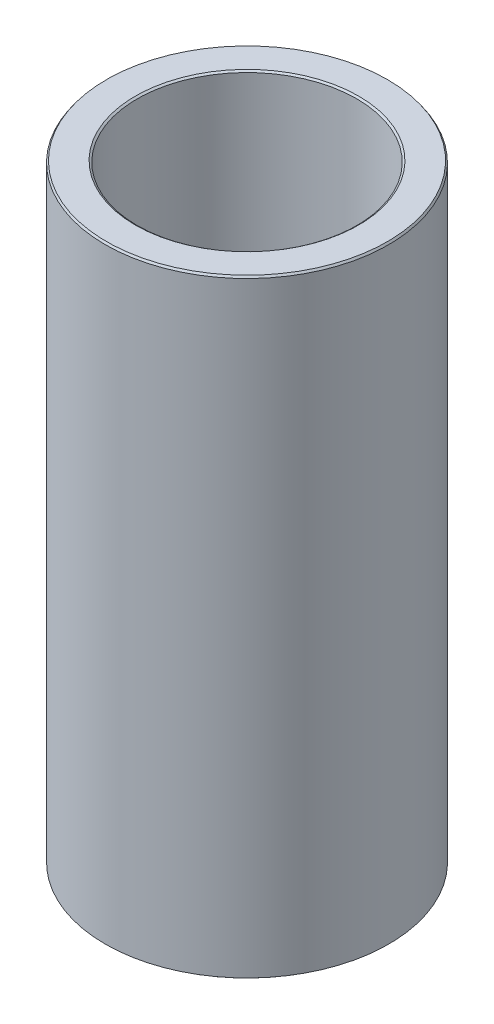
ISO-10303-21;
HEADER;
FILE_DESCRIPTION(('STEP AP214'),'2;1');
FILE_NAME('part.step','',(''),(''),'','','');
FILE_SCHEMA(('AUTOMOTIVE_DESIGN { 1 0 10303 214 1 1 1 1 }'));
ENDSEC;
DATA;
#1=APPLICATION_CONTEXT('core data for automotive mechanical design processes');
#2=APPLICATION_PROTOCOL_DEFINITION('international standard','automotive_design',2000,#1);
#3=PRODUCT_CONTEXT('',#1,'mechanical');
#4=PRODUCT('Part','Part','',(#3));
#5=PRODUCT_RELATED_PRODUCT_CATEGORY('part','',(#4));
#6=PRODUCT_DEFINITION_FORMATION('','',#4);
#7=PRODUCT_DEFINITION_CONTEXT('part definition',#1,'design');
#8=PRODUCT_DEFINITION('design','',#6,#7);
#9=PRODUCT_DEFINITION_SHAPE('','',#8);
#10=(LENGTH_UNIT() NAMED_UNIT(*) SI_UNIT(.MILLI.,.METRE.));
#11=(NAMED_UNIT(*) PLANE_ANGLE_UNIT() SI_UNIT($,.RADIAN.));
#12=(NAMED_UNIT(*) SI_UNIT($,.STERADIAN.) SOLID_ANGLE_UNIT());
#13=UNCERTAINTY_MEASURE_WITH_UNIT(LENGTH_MEASURE(1.E-05),#10,'distance_accuracy_value','');
#14=(GEOMETRIC_REPRESENTATION_CONTEXT(3) GLOBAL_UNCERTAINTY_ASSIGNED_CONTEXT((#13)) GLOBAL_UNIT_ASSIGNED_CONTEXT((#10,
#11,#12)) REPRESENTATION_CONTEXT('',''));
#15=CARTESIAN_POINT('',(0.,0.,0.));
#16=DIRECTION('',(0.,0.,1.));
#17=DIRECTION('',(1.,0.,0.));
#18=AXIS2_PLACEMENT_3D('',#15,#16,#17);
#19=CARTESIAN_POINT('',(0.,150.343041636267,0.));
#20=DIRECTION('',(0.,-1.,0.));
#21=DIRECTION('',(0.,0.,-1.));
#22=AXIS2_PLACEMENT_3D('',#19,#20,#21);
#23=CYLINDRICAL_SURFACE('',#22,35.);
#24=CARTESIAN_POINT('',(0.,0.338114798134531,0.));
#25=DIRECTION('',(0.,1.,0.));
#26=DIRECTION('',(0.,0.,1.));
#27=AXIS2_PLACEMENT_3D('',#24,#25,#26);
#28=CIRCLE('',#27,35.);
#29=CARTESIAN_POINT('',(0.,0.338114798134531,35.));
#30=VERTEX_POINT('',#29);
#31=EDGE_CURVE('E10',#30,#30,#28,.T.);
#32=ORIENTED_EDGE('',*,*,#31,.T.);
#33=EDGE_LOOP('',(#32));
#34=FACE_BOUND('',#33,.T.);
#35=CARTESIAN_POINT('',(0.,149.871830161686,0.));
#36=DIRECTION('',(0.,1.,0.));
#37=DIRECTION('',(0.,0.,1.));
#38=AXIS2_PLACEMENT_3D('',#35,#36,#37);
#39=CIRCLE('',#38,35.);
#40=CARTESIAN_POINT('',(0.,149.871830161686,-35.));
#41=VERTEX_POINT('',#40);
#42=EDGE_CURVE('E50',#41,#41,#39,.F.);
#43=ORIENTED_EDGE('',*,*,#42,.T.);
#44=EDGE_LOOP('',(#43));
#45=FACE_BOUND('',#44,.T.);
#46=ADVANCED_FACE('F39',(#34,#45),#23,.T.);
#47=CARTESIAN_POINT('',(0.,150.343041636267,0.));
#48=DIRECTION('',(0.,1.,0.));
#49=DIRECTION('',(0.,0.,1.));
#50=AXIS2_PLACEMENT_3D('',#47,#48,#49);
#51=PLANE('',#50);
#52=CARTESIAN_POINT('',(0.,150.343041636267,0.));
#53=DIRECTION('',(0.,1.,0.));
#54=DIRECTION('',(0.,0.,1.));
#55=AXIS2_PLACEMENT_3D('',#52,#53,#54);
#56=CIRCLE('',#55,27.5732990055292);
#57=CARTESIAN_POINT('',(0.,150.343041636267,27.5732990055292));
#58=VERTEX_POINT('',#57);
#59=EDGE_CURVE('E58',#58,#58,#56,.F.);
#60=ORIENTED_EDGE('',*,*,#59,.T.);
#61=EDGE_LOOP('',(#60));
#62=FACE_BOUND('',#61,.T.);
#63=CARTESIAN_POINT('',(0.,150.343041636267,0.));
#64=DIRECTION('',(0.,1.,0.));
#65=DIRECTION('',(0.,0.,1.));
#66=AXIS2_PLACEMENT_3D('',#63,#64,#65);
#67=CIRCLE('',#66,34.6618852018655);
#68=CARTESIAN_POINT('',(0.,150.343041636267,-34.6618852018655));
#69=VERTEX_POINT('',#68);
#70=EDGE_CURVE('E61',#69,#69,#67,.T.);
#71=ORIENTED_EDGE('',*,*,#70,.T.);
#72=EDGE_LOOP('',(#71));
#73=FACE_BOUND('',#72,.T.);
#74=ADVANCED_FACE('F88',(#62,#73),#51,.T.);
#75=CARTESIAN_POINT('',(0.,0.,0.));
#76=DIRECTION('',(0.,1.,0.));
#77=DIRECTION('',(0.,0.,1.));
#78=AXIS2_PLACEMENT_3D('',#75,#76,#77);
#79=PLANE('',#78);
#80=CARTESIAN_POINT('',(0.,0.,0.));
#81=DIRECTION('',(0.,1.,0.));
#82=DIRECTION('',(0.,0.,1.));
#83=AXIS2_PLACEMENT_3D('',#80,#81,#82);
#84=CIRCLE('',#83,27.4402023290819);
#85=CARTESIAN_POINT('',(0.,0.,-27.4402023290819));
#86=VERTEX_POINT('',#85);
#87=EDGE_CURVE('E51',#86,#86,#84,.T.);
#88=ORIENTED_EDGE('',*,*,#87,.T.);
#89=EDGE_LOOP('',(#88));
#90=FACE_BOUND('',#89,.T.);
#91=CARTESIAN_POINT('',(0.,0.,0.));
#92=DIRECTION('',(0.,1.,0.));
#93=DIRECTION('',(0.,0.,1.));
#94=AXIS2_PLACEMENT_3D('',#91,#92,#93);
#95=CIRCLE('',#94,34.5287885254182);
#96=CARTESIAN_POINT('',(0.,0.,34.5287885254182));
#97=VERTEX_POINT('',#96);
#98=EDGE_CURVE('E54',#97,#97,#95,.F.);
#99=ORIENTED_EDGE('',*,*,#98,.T.);
#100=EDGE_LOOP('',(#99));
#101=FACE_BOUND('',#100,.T.);
#102=ADVANCED_FACE('F83',(#90,#101),#79,.F.);
#103=CARTESIAN_POINT('',(0.,150.343041636267,0.));
#104=DIRECTION('',(0.,-1.,0.));
#105=DIRECTION('',(0.,0.,-1.));
#106=AXIS2_PLACEMENT_3D('',#103,#104,#105);
#107=CYLINDRICAL_SURFACE('',#106,27.1020875309474);
#108=CARTESIAN_POINT('',(0.,150.004926838133,0.));
#109=DIRECTION('',(0.,1.,0.));
#110=DIRECTION('',(0.,0.,1.));
#111=AXIS2_PLACEMENT_3D('',#108,#109,#110);
#112=CIRCLE('',#111,27.1020875309474);
#113=CARTESIAN_POINT('',(0.,150.004926838133,27.1020875309474));
#114=VERTEX_POINT('',#113);
#115=EDGE_CURVE('E67',#114,#114,#112,.T.);
#116=ORIENTED_EDGE('',*,*,#115,.T.);
#117=EDGE_LOOP('',(#116));
#118=FACE_BOUND('',#117,.T.);
#119=CARTESIAN_POINT('',(0.,0.471211474581762,0.));
#120=DIRECTION('',(0.,1.,0.));
#121=DIRECTION('',(0.,0.,1.));
#122=AXIS2_PLACEMENT_3D('',#119,#120,#121);
#123=CIRCLE('',#122,27.1020875309474);
#124=CARTESIAN_POINT('',(0.,0.471211474581762,-27.1020875309474));
#125=VERTEX_POINT('',#124);
#126=EDGE_CURVE('E69',#125,#125,#123,.F.);
#127=ORIENTED_EDGE('',*,*,#126,.T.);
#128=EDGE_LOOP('',(#127));
#129=FACE_BOUND('',#128,.T.);
#130=ADVANCED_FACE('F71',(#118,#129),#107,.F.);
#131=CARTESIAN_POINT('',(0.,150.004926838133,0.));
#132=DIRECTION('',(0.,1.,0.));
#133=DIRECTION('',(0.,0.,1.));
#134=AXIS2_PLACEMENT_3D('',#131,#132,#133);
#135=CONICAL_SURFACE('',#134,27.1020875309474,0.948392886026245);
#136=ORIENTED_EDGE('',*,*,#59,.F.);
#137=EDGE_LOOP('',(#136));
#138=FACE_BOUND('',#137,.T.);
#139=ORIENTED_EDGE('',*,*,#115,.F.);
#140=EDGE_LOOP('',(#139));
#141=FACE_BOUND('',#140,.T.);
#142=ADVANCED_FACE('F77',(#138,#141),#135,.F.);
#143=CARTESIAN_POINT('',(0.,0.,0.));
#144=DIRECTION('',(0.,-1.,0.));
#145=DIRECTION('',(0.,0.,-1.));
#146=AXIS2_PLACEMENT_3D('',#143,#144,#145);
#147=CONICAL_SURFACE('',#146,27.4402023290819,0.622403440768663);
#148=CARTESIAN_POINT('',(0.,0.471211474581762,-27.1020875309474));
#149=CARTESIAN_POINT('',(0.,0.466303021721536,-27.1056095600946));
#150=CARTESIAN_POINT('',(0.,0.461394568861309,-27.1091315892418));
#151=CARTESIAN_POINT('',(0.,0.451577663140855,-27.1161756475363));
#152=CARTESIAN_POINT('',(0.,0.446669210280628,-27.1196976766835));
#153=CARTESIAN_POINT('',(0.,0.436852304560175,-27.126741734978));
#154=CARTESIAN_POINT('',(0.,0.431943851699949,-27.1302637641252));
#155=CARTESIAN_POINT('',(0.,0.422126945979495,-27.1373078224197));
#156=CARTESIAN_POINT('',(0.,0.417218493119268,-27.140829851567));
#157=CARTESIAN_POINT('',(0.,0.407401587398815,-27.1478739098614));
#158=CARTESIAN_POINT('',(0.,0.402493134538588,-27.1513959390087));
#159=CARTESIAN_POINT('',(0.,0.392676228818135,-27.1584399973031));
#160=CARTESIAN_POINT('',(0.,0.387767775957908,-27.1619620264504));
#161=CARTESIAN_POINT('',(0.,0.377950870237455,-27.1690060847448));
#162=CARTESIAN_POINT('',(0.,0.373042417377228,-27.1725281138921));
#163=CARTESIAN_POINT('',(0.,0.363225511656775,-27.1795721721865));
#164=CARTESIAN_POINT('',(0.,0.358317058796548,-27.1830942013338));
#165=CARTESIAN_POINT('',(0.,0.348500153076095,-27.1901382596282));
#166=CARTESIAN_POINT('',(0.,0.343591700215868,-27.1936602887755));
#167=CARTESIAN_POINT('',(0.,0.333774794495415,-27.2007043470699));
#168=CARTESIAN_POINT('',(0.,0.328866341635188,-27.2042263762172));
#169=CARTESIAN_POINT('',(0.,0.319049435914735,-27.2112704345116));
#170=CARTESIAN_POINT('',(0.,0.314140983054508,-27.2147924636589));
#171=CARTESIAN_POINT('',(0.,0.304324077334055,-27.2218365219533));
#172=CARTESIAN_POINT('',(0.,0.299415624473828,-27.2253585511006));
#173=CARTESIAN_POINT('',(0.,0.289598718753374,-27.2324026093951));
#174=CARTESIAN_POINT('',(0.,0.284690265893147,-27.2359246385423));
#175=CARTESIAN_POINT('',(0.,0.274873360172694,-27.2429686968368));
#176=CARTESIAN_POINT('',(0.,0.269964907312468,-27.246490725984));
#177=CARTESIAN_POINT('',(0.,0.260148001592015,-27.2535347842785));
#178=CARTESIAN_POINT('',(0.,0.255239548731788,-27.2570568134257));
#179=CARTESIAN_POINT('',(0.,0.245422643011334,-27.2641008717202));
#180=CARTESIAN_POINT('',(0.,0.240514190151108,-27.2676229008674));
#181=CARTESIAN_POINT('',(0.,0.230697284430654,-27.2746669591619));
#182=CARTESIAN_POINT('',(0.,0.225788831570428,-27.2781889883091));
#183=CARTESIAN_POINT('',(0.,0.215971925849974,-27.2852330466036));
#184=CARTESIAN_POINT('',(0.,0.211063472989747,-27.2887550757508));
#185=CARTESIAN_POINT('',(0.,0.201246567269294,-27.2957991340453));
#186=CARTESIAN_POINT('',(0.,0.196338114409068,-27.2993211631925));
#187=CARTESIAN_POINT('',(0.,0.186521208688614,-27.306365221487));
#188=CARTESIAN_POINT('',(0.,0.181612755828387,-27.3098872506342));
#189=CARTESIAN_POINT('',(0.,0.171795850107934,-27.3169313089287));
#190=CARTESIAN_POINT('',(0.,0.166887397247707,-27.3204533380759));
#191=CARTESIAN_POINT('',(0.,0.157070491527254,-27.3274973963704));
#192=CARTESIAN_POINT('',(0.,0.152162038667027,-27.3310194255176));
#193=CARTESIAN_POINT('',(0.,0.142345132946574,-27.3380634838121));
#194=CARTESIAN_POINT('',(0.,0.137436680086347,-27.3415855129593));
#195=CARTESIAN_POINT('',(0.,0.127619774365894,-27.3486295712538));
#196=CARTESIAN_POINT('',(0.,0.122711321505667,-27.352151600401));
#197=CARTESIAN_POINT('',(0.,0.112894415785214,-27.3591956586955));
#198=CARTESIAN_POINT('',(0.,0.107985962924987,-27.3627176878427));
#199=CARTESIAN_POINT('',(0.,0.0981690572045341,-27.3697617461372));
#200=CARTESIAN_POINT('',(0.,0.0932606043443071,-27.3732837752844));
#201=CARTESIAN_POINT('',(0.,0.0834436986238536,-27.3803278335789));
#202=CARTESIAN_POINT('',(0.,0.0785352457636269,-27.3838498627261));
#203=CARTESIAN_POINT('',(0.,0.0687183400431736,-27.3908939210206));
#204=CARTESIAN_POINT('',(0.,0.063809887182947,-27.3944159501678));
#205=CARTESIAN_POINT('',(0.,0.0539929814624934,-27.4014600084623));
#206=CARTESIAN_POINT('',(0.,0.0490845286022665,-27.4049820376095));
#207=CARTESIAN_POINT('',(0.,0.0392676228818133,-27.412026095904));
#208=CARTESIAN_POINT('',(0.,0.034359170021587,-27.4155481250513));
#209=CARTESIAN_POINT('',(0.,0.0245422643011338,-27.4225921833457));
#210=CARTESIAN_POINT('',(0.,0.0196338114409069,-27.426114212493));
#211=CARTESIAN_POINT('',(0.,0.00981690572045319,-27.4331582707874));
#212=CARTESIAN_POINT('',(0.,0.00490845286022631,-27.4366802999347));
#213=CARTESIAN_POINT('',(0.,0.,-27.4402023290819));
#214=B_SPLINE_CURVE_WITH_KNOTS('',3,(#148,#149,#150,#151,#152,#153,#154,#155,#156,#157,#158,
#159,#160,#161,#162,#163,#164,#165,#166,#167,#168,#169,#170,#171,#172,#173,#174,#175,#176,#177,
#178,#179,#180,#181,#182,#183,#184,#185,#186,#187,#188,#189,#190,#191,#192,#193,#194,#195,#196,
#197,#198,#199,#200,#201,#202,#203,#204,#205,#206,#207,#208,#209,#210,#211,#212,#213),
.UNSPECIFIED.,.F.,.F.,(4,2,2,2,2,2,2,2,2,2,2,2,2,2,2,2,2,2,2,2,2,2,2,2,2,2,2,2,2,2,2,2,4),(0.,
0.0181239727751762,0.0362479455503523,0.0543719183255305,0.0724958911007067,0.0906198638758828,
0.108743836651059,0.126867809426235,0.144991782201413,0.163115754976589,0.181239727751766,
0.199363700526942,0.217487673302118,0.235611646077294,0.253735618852472,0.271859591627648,
0.289983564402825,0.308107537178001,0.326231509953177,0.344355482728355,0.362479455503531,
0.380603428278707,0.398727401053883,0.41685137382906,0.434975346604236,0.453099319379414,
0.47122329215459,0.489347264929766,0.507471237704942,0.525595210480119,0.543719183255297,
0.561843156030473,0.579967128805649),.UNSPECIFIED.);
#215=EDGE_CURVE('BSEAM73',#125,#86,#214,.T.);
#216=ORIENTED_EDGE('',*,*,#126,.F.);
#217=ORIENTED_EDGE('',*,*,#87,.F.);
#218=ORIENTED_EDGE('',*,*,#215,.T.);
#219=ORIENTED_EDGE('',*,*,#215,.F.);
#220=EDGE_LOOP('',(#216,#218,#217,#219));
#221=FACE_BOUND('',#220,.T.);
#222=ADVANCED_FACE('F73',(#221),#147,.F.);
#223=CARTESIAN_POINT('',(0.,0.338114798134531,0.));
#224=DIRECTION('',(0.,1.,0.));
#225=DIRECTION('',(0.,0.,1.));
#226=AXIS2_PLACEMENT_3D('',#223,#224,#225);
#227=CONICAL_SURFACE('',#226,35.,0.948392886026231);
#228=ORIENTED_EDGE('',*,*,#98,.F.);
#229=EDGE_LOOP('',(#228));
#230=FACE_BOUND('',#229,.T.);
#231=ORIENTED_EDGE('',*,*,#31,.F.);
#232=EDGE_LOOP('',(#231));
#233=FACE_BOUND('',#232,.T.);
#234=ADVANCED_FACE('F76',(#230,#233),#227,.T.);
#235=CARTESIAN_POINT('',(0.,150.343041636267,0.));
#236=DIRECTION('',(0.,-1.,0.));
#237=DIRECTION('',(0.,0.,-1.));
#238=AXIS2_PLACEMENT_3D('',#235,#236,#237);
#239=CONICAL_SURFACE('',#238,34.6618852018655,0.622403440768635);
#240=CARTESIAN_POINT('',(0.,149.871830161686,-35.));
#241=CARTESIAN_POINT('',(0.,149.876738614546,-34.9964779708528));
#242=CARTESIAN_POINT('',(0.,149.881647067406,-34.9929559417055));
#243=CARTESIAN_POINT('',(0.,149.891463973126,-34.9859118834111));
#244=CARTESIAN_POINT('',(0.,149.896372425987,-34.9823898542638));
#245=CARTESIAN_POINT('',(0.,149.906189331707,-34.9753457959694));
#246=CARTESIAN_POINT('',(0.,149.911097784567,-34.9718237668221));
#247=CARTESIAN_POINT('',(0.,149.920914690288,-34.9647797085277));
#248=CARTESIAN_POINT('',(0.,149.925823143148,-34.9612576793804));
#249=CARTESIAN_POINT('',(0.,149.935640048868,-34.954213621086));
#250=CARTESIAN_POINT('',(0.,149.940548501729,-34.9506915919387));
#251=CARTESIAN_POINT('',(0.,149.950365407449,-34.9436475336443));
#252=CARTESIAN_POINT('',(0.,149.955273860309,-34.940125504497));
#253=CARTESIAN_POINT('',(0.,149.96509076603,-34.9330814462026));
#254=CARTESIAN_POINT('',(0.,149.96999921889,-34.9295594170553));
#255=CARTESIAN_POINT('',(0.,149.979816124611,-34.9225153587609));
#256=CARTESIAN_POINT('',(0.,149.984724577471,-34.9189933296136));
#257=CARTESIAN_POINT('',(0.,149.994541483191,-34.9119492713192));
#258=CARTESIAN_POINT('',(0.,149.999449936051,-34.9084272421719));
#259=CARTESIAN_POINT('',(0.,150.009266841772,-34.9013831838775));
#260=CARTESIAN_POINT('',(0.,150.014175294632,-34.8978611547302));
#261=CARTESIAN_POINT('',(0.,150.023992200353,-34.8908170964357));
#262=CARTESIAN_POINT('',(0.,150.028900653213,-34.8872950672885));
#263=CARTESIAN_POINT('',(0.,150.038717558933,-34.880251008994));
#264=CARTESIAN_POINT('',(0.,150.043626011793,-34.8767289798468));
#265=CARTESIAN_POINT('',(0.,150.053442917514,-34.8696849215523));
#266=CARTESIAN_POINT('',(0.,150.058351370374,-34.8661628924051));
#267=CARTESIAN_POINT('',(0.,150.068168276095,-34.8591188341106));
#268=CARTESIAN_POINT('',(0.,150.073076728955,-34.8555968049634));
#269=CARTESIAN_POINT('',(0.,150.082893634675,-34.8485527466689));
#270=CARTESIAN_POINT('',(0.,150.087802087536,-34.8450307175217));
#271=CARTESIAN_POINT('',(0.,150.097618993256,-34.8379866592272));
#272=CARTESIAN_POINT('',(0.,150.102527446116,-34.83446463008));
#273=CARTESIAN_POINT('',(0.,150.112344351837,-34.8274205717855));
#274=CARTESIAN_POINT('',(0.,150.117252804697,-34.8238985426383));
#275=CARTESIAN_POINT('',(0.,150.127069710417,-34.8168544843438));
#276=CARTESIAN_POINT('',(0.,150.131978163278,-34.8133324551966));
#277=CARTESIAN_POINT('',(0.,150.141795068998,-34.8062883969021));
#278=CARTESIAN_POINT('',(0.,150.146703521858,-34.8027663677549));
#279=CARTESIAN_POINT('',(0.,150.156520427579,-34.7957223094604));
#280=CARTESIAN_POINT('',(0.,150.161428880439,-34.7922002803132));
#281=CARTESIAN_POINT('',(0.,150.171245786159,-34.7851562220187));
#282=CARTESIAN_POINT('',(0.,150.17615423902,-34.7816341928715));
#283=CARTESIAN_POINT('',(0.,150.18597114474,-34.774590134577));
#284=CARTESIAN_POINT('',(0.,150.1908795976,-34.7710681054298));
#285=CARTESIAN_POINT('',(0.,150.200696503321,-34.7640240471353));
#286=CARTESIAN_POINT('',(0.,150.205604956181,-34.7605020179881));
#287=CARTESIAN_POINT('',(0.,150.215421861901,-34.7534579596936));
#288=CARTESIAN_POINT('',(0.,150.220330314762,-34.7499359305464));
#289=CARTESIAN_POINT('',(0.,150.230147220482,-34.7428918722519));
#290=CARTESIAN_POINT('',(0.,150.235055673342,-34.7393698431047));
#291=CARTESIAN_POINT('',(0.,150.244872579063,-34.7323257848102));
#292=CARTESIAN_POINT('',(0.,150.249781031923,-34.728803755663));
#293=CARTESIAN_POINT('',(0.,150.259597937643,-34.7217596973685));
#294=CARTESIAN_POINT('',(0.,150.264506390504,-34.7182376682212));
#295=CARTESIAN_POINT('',(0.,150.274323296224,-34.7111936099268));
#296=CARTESIAN_POINT('',(0.,150.279231749084,-34.7076715807795));
#297=CARTESIAN_POINT('',(0.,150.289048654805,-34.7006275224851));
#298=CARTESIAN_POINT('',(0.,150.293957107665,-34.6971054933378));
#299=CARTESIAN_POINT('',(0.,150.303774013386,-34.6900614350434));
#300=CARTESIAN_POINT('',(0.,150.308682466246,-34.6865394058961));
#301=CARTESIAN_POINT('',(0.,150.318499371966,-34.6794953476017));
#302=CARTESIAN_POINT('',(0.,150.323407824826,-34.6759733184544));
#303=CARTESIAN_POINT('',(0.,150.333224730547,-34.66892926016));
#304=CARTESIAN_POINT('',(0.,150.338133183407,-34.6654072310127));
#305=CARTESIAN_POINT('',(0.,150.343041636267,-34.6618852018655));
#306=B_SPLINE_CURVE_WITH_KNOTS('',3,(#240,#241,#242,#243,#244,#245,#246,#247,#248,#249,#250,
#251,#252,#253,#254,#255,#256,#257,#258,#259,#260,#261,#262,#263,#264,#265,#266,#267,#268,#269,
#270,#271,#272,#273,#274,#275,#276,#277,#278,#279,#280,#281,#282,#283,#284,#285,#286,#287,#288,
#289,#290,#291,#292,#293,#294,#295,#296,#297,#298,#299,#300,#301,#302,#303,#304,#305),
.UNSPECIFIED.,.F.,.F.,(4,2,2,2,2,2,2,2,2,2,2,2,2,2,2,2,2,2,2,2,2,2,2,2,2,2,2,2,2,2,2,2,4),(0.,
0.0181239727751585,0.0362479455503396,0.0543719183255207,0.0724958911007018,0.0906198638758829,
0.108743836651041,0.126867809426223,0.144991782201404,0.163115754976585,0.18123972775177,
0.199363700526928,0.217487673302109,0.235611646077291,0.253735618852472,0.271859591627653,
0.289983564402834,0.308107537177992,0.326231509953173,0.344355482728355,0.362479455503536,
0.380603428278721,0.398727401053879,0.41685137382906,0.434975346604241,0.453099319379423,
0.471223292154604,0.489347264929762,0.507471237704943,0.525595210480125,0.543719183255306,
0.561843156030487,0.579967128805672),.UNSPECIFIED.);
#307=EDGE_CURVE('BSEAM45',#41,#69,#306,.T.);
#308=ORIENTED_EDGE('',*,*,#42,.F.);
#309=ORIENTED_EDGE('',*,*,#70,.F.);
#310=ORIENTED_EDGE('',*,*,#307,.T.);
#311=ORIENTED_EDGE('',*,*,#307,.F.);
#312=EDGE_LOOP('',(#308,#310,#309,#311));
#313=FACE_BOUND('',#312,.T.);
#314=ADVANCED_FACE('F45',(#313),#239,.T.);
#315=CLOSED_SHELL('',(#46,#74,#102,#130,#142,#222,#234,#314));
#316=MANIFOLD_SOLID_BREP('B2',#315);
#317=ADVANCED_BREP_SHAPE_REPRESENTATION('',(#18,#316),#14);
#318=SHAPE_DEFINITION_REPRESENTATION(#9,#317);
ENDSEC;
END-ISO-10303-21;
